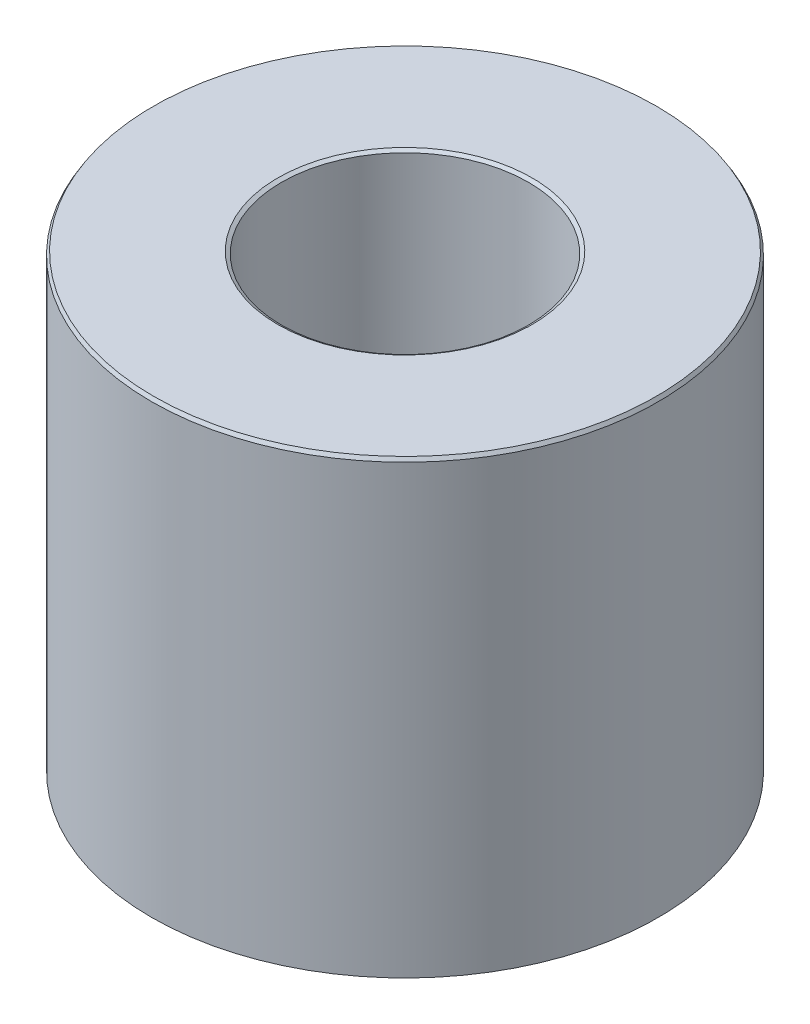
ISO-10303-21;
HEADER;
FILE_DESCRIPTION(('STEP AP214'),'2;1');
FILE_NAME('part.step','',(''),(''),'','','');
FILE_SCHEMA(('AUTOMOTIVE_DESIGN { 1 0 10303 214 1 1 1 1 }'));
ENDSEC;
DATA;
#1=APPLICATION_CONTEXT('core data for automotive mechanical design processes');
#2=APPLICATION_PROTOCOL_DEFINITION('international standard','automotive_design',2000,#1);
#3=PRODUCT_CONTEXT('',#1,'mechanical');
#4=PRODUCT('Part','Part','',(#3));
#5=PRODUCT_RELATED_PRODUCT_CATEGORY('part','',(#4));
#6=PRODUCT_DEFINITION_FORMATION('','',#4);
#7=PRODUCT_DEFINITION_CONTEXT('part definition',#1,'design');
#8=PRODUCT_DEFINITION('design','',#6,#7);
#9=PRODUCT_DEFINITION_SHAPE('','',#8);
#10=(LENGTH_UNIT() NAMED_UNIT(*) SI_UNIT(.MILLI.,.METRE.));
#11=(NAMED_UNIT(*) PLANE_ANGLE_UNIT() SI_UNIT($,.RADIAN.));
#12=(NAMED_UNIT(*) SI_UNIT($,.STERADIAN.) SOLID_ANGLE_UNIT());
#13=UNCERTAINTY_MEASURE_WITH_UNIT(LENGTH_MEASURE(1.E-05),#10,'distance_accuracy_value','');
#14=(GEOMETRIC_REPRESENTATION_CONTEXT(3) GLOBAL_UNCERTAINTY_ASSIGNED_CONTEXT((#13)) GLOBAL_UNIT_ASSIGNED_CONTEXT((#10,
#11,#12)) REPRESENTATION_CONTEXT('',''));
#15=CARTESIAN_POINT('',(0.,0.,0.));
#16=DIRECTION('',(0.,0.,1.));
#17=DIRECTION('',(1.,0.,0.));
#18=AXIS2_PLACEMENT_3D('',#15,#16,#17);
#19=CARTESIAN_POINT('',(0.,89.2140049411221,0.));
#20=DIRECTION('',(0.,-1.,0.));
#21=DIRECTION('',(0.,0.,-1.));
#22=AXIS2_PLACEMENT_3D('',#19,#20,#21);
#23=CYLINDRICAL_SURFACE('',#22,50.);
#24=CARTESIAN_POINT('',(0.,0.421142839623134,0.));
#25=DIRECTION('',(0.,1.,0.));
#26=DIRECTION('',(0.,0.,1.));
#27=AXIS2_PLACEMENT_3D('',#24,#25,#26);
#28=CIRCLE('',#27,50.);
#29=CARTESIAN_POINT('',(0.,0.421142839623134,50.));
#30=VERTEX_POINT('',#29);
#31=EDGE_CURVE('E10',#30,#30,#28,.T.);
#32=ORIENTED_EDGE('',*,*,#31,.T.);
#33=EDGE_LOOP('',(#32));
#34=FACE_BOUND('',#33,.T.);
#35=CARTESIAN_POINT('',(0.,88.5207360142283,0.));
#36=DIRECTION('',(0.,1.,0.));
#37=DIRECTION('',(0.,0.,1.));
#38=AXIS2_PLACEMENT_3D('',#35,#36,#37);
#39=CIRCLE('',#38,50.);
#40=CARTESIAN_POINT('',(0.,88.5207360142283,50.));
#41=VERTEX_POINT('',#40);
#42=EDGE_CURVE('E50',#41,#41,#39,.F.);
#43=ORIENTED_EDGE('',*,*,#42,.T.);
#44=EDGE_LOOP('',(#43));
#45=FACE_BOUND('',#44,.T.);
#46=ADVANCED_FACE('F39',(#34,#45),#23,.T.);
#47=CARTESIAN_POINT('',(0.,89.2140049411221,0.));
#48=DIRECTION('',(0.,1.,0.));
#49=DIRECTION('',(0.,0.,1.));
#50=AXIS2_PLACEMENT_3D('',#47,#48,#49);
#51=PLANE('',#50);
#52=CARTESIAN_POINT('',(0.,89.2140049411221,0.));
#53=DIRECTION('',(0.,1.,0.));
#54=DIRECTION('',(0.,0.,1.));
#55=AXIS2_PLACEMENT_3D('',#52,#53,#54);
#56=CIRCLE('',#55,25.0752482740782);
#57=CARTESIAN_POINT('',(0.,89.2140049411221,25.0752482740782));
#58=VERTEX_POINT('',#57);
#59=EDGE_CURVE('E58',#58,#58,#56,.F.);
#60=ORIENTED_EDGE('',*,*,#59,.T.);
#61=EDGE_LOOP('',(#60));
#62=FACE_BOUND('',#61,.T.);
#63=CARTESIAN_POINT('',(0.,89.2140049411221,0.));
#64=DIRECTION('',(0.,1.,0.));
#65=DIRECTION('',(0.,0.,1.));
#66=AXIS2_PLACEMENT_3D('',#63,#64,#65);
#67=CIRCLE('',#66,49.5788571603769);
#68=CARTESIAN_POINT('',(0.,89.2140049411221,49.5788571603769));
#69=VERTEX_POINT('',#68);
#70=EDGE_CURVE('E61',#69,#69,#67,.T.);
#71=ORIENTED_EDGE('',*,*,#70,.T.);
#72=EDGE_LOOP('',(#71));
#73=FACE_BOUND('',#72,.T.);
#74=ADVANCED_FACE('F88',(#62,#73),#51,.T.);
#75=CARTESIAN_POINT('',(0.,0.,0.));
#76=DIRECTION('',(0.,1.,0.));
#77=DIRECTION('',(0.,0.,1.));
#78=AXIS2_PLACEMENT_3D('',#75,#76,#77);
#79=PLANE('',#78);
#80=CARTESIAN_POINT('',(0.,0.,0.));
#81=DIRECTION('',(0.,1.,0.));
#82=DIRECTION('',(0.,0.,1.));
#83=AXIS2_PLACEMENT_3D('',#80,#81,#82);
#84=CIRCLE('',#83,24.8031221868074);
#85=CARTESIAN_POINT('',(0.,0.,24.8031221868074));
#86=VERTEX_POINT('',#85);
#87=EDGE_CURVE('E51',#86,#86,#84,.T.);
#88=ORIENTED_EDGE('',*,*,#87,.T.);
#89=EDGE_LOOP('',(#88));
#90=FACE_BOUND('',#89,.T.);
#91=CARTESIAN_POINT('',(0.,0.,0.));
#92=DIRECTION('',(0.,1.,0.));
#93=DIRECTION('',(0.,0.,1.));
#94=AXIS2_PLACEMENT_3D('',#91,#92,#93);
#95=CIRCLE('',#94,49.3067310731061);
#96=CARTESIAN_POINT('',(0.,0.,49.3067310731061));
#97=VERTEX_POINT('',#96);
#98=EDGE_CURVE('E54',#97,#97,#95,.F.);
#99=ORIENTED_EDGE('',*,*,#98,.T.);
#100=EDGE_LOOP('',(#99));
#101=FACE_BOUND('',#100,.T.);
#102=ADVANCED_FACE('F83',(#90,#101),#79,.F.);
#103=CARTESIAN_POINT('',(0.,89.2140049411221,0.));
#104=DIRECTION('',(0.,-1.,0.));
#105=DIRECTION('',(0.,0.,-1.));
#106=AXIS2_PLACEMENT_3D('',#103,#104,#105);
#107=CYLINDRICAL_SURFACE('',#106,24.3819793471842);
#108=CARTESIAN_POINT('',(0.,88.792862101499,0.));
#109=DIRECTION('',(0.,1.,0.));
#110=DIRECTION('',(0.,0.,1.));
#111=AXIS2_PLACEMENT_3D('',#108,#109,#110);
#112=CIRCLE('',#111,24.3819793471842);
#113=CARTESIAN_POINT('',(0.,88.792862101499,24.3819793471842));
#114=VERTEX_POINT('',#113);
#115=EDGE_CURVE('E67',#114,#114,#112,.T.);
#116=ORIENTED_EDGE('',*,*,#115,.T.);
#117=EDGE_LOOP('',(#116));
#118=FACE_BOUND('',#117,.T.);
#119=CARTESIAN_POINT('',(0.,0.69326892689392,0.));
#120=DIRECTION('',(0.,1.,0.));
#121=DIRECTION('',(0.,0.,1.));
#122=AXIS2_PLACEMENT_3D('',#119,#120,#121);
#123=CIRCLE('',#122,24.3819793471842);
#124=CARTESIAN_POINT('',(0.,0.69326892689392,24.3819793471842));
#125=VERTEX_POINT('',#124);
#126=EDGE_CURVE('E69',#125,#125,#123,.F.);
#127=ORIENTED_EDGE('',*,*,#126,.T.);
#128=EDGE_LOOP('',(#127));
#129=FACE_BOUND('',#128,.T.);
#130=ADVANCED_FACE('F71',(#118,#129),#107,.F.);
#131=CARTESIAN_POINT('',(0.,88.792862101499,0.));
#132=DIRECTION('',(0.,1.,0.));
#133=DIRECTION('',(0.,0.,1.));
#134=AXIS2_PLACEMENT_3D('',#131,#132,#133);
#135=CONICAL_SURFACE('',#134,24.3819793471842,1.02489936333593);
#136=ORIENTED_EDGE('',*,*,#59,.F.);
#137=EDGE_LOOP('',(#136));
#138=FACE_BOUND('',#137,.T.);
#139=ORIENTED_EDGE('',*,*,#115,.F.);
#140=EDGE_LOOP('',(#139));
#141=FACE_BOUND('',#140,.T.);
#142=ADVANCED_FACE('F77',(#138,#141),#135,.F.);
#143=CARTESIAN_POINT('',(0.,0.,0.));
#144=DIRECTION('',(0.,-1.,0.));
#145=DIRECTION('',(0.,0.,-1.));
#146=AXIS2_PLACEMENT_3D('',#143,#144,#145);
#147=CONICAL_SURFACE('',#146,24.8031221868074,0.54589696345894);
#148=ORIENTED_EDGE('',*,*,#126,.F.);
#149=EDGE_LOOP('',(#148));
#150=FACE_BOUND('',#149,.T.);
#151=ORIENTED_EDGE('',*,*,#87,.F.);
#152=EDGE_LOOP('',(#151));
#153=FACE_BOUND('',#152,.T.);
#154=ADVANCED_FACE('F73',(#150,#153),#147,.F.);
#155=CARTESIAN_POINT('',(0.,0.421142839623134,0.));
#156=DIRECTION('',(0.,1.,0.));
#157=DIRECTION('',(0.,0.,1.));
#158=AXIS2_PLACEMENT_3D('',#155,#156,#157);
#159=CONICAL_SURFACE('',#158,50.,1.02489936333595);
#160=ORIENTED_EDGE('',*,*,#98,.F.);
#161=EDGE_LOOP('',(#160));
#162=FACE_BOUND('',#161,.T.);
#163=ORIENTED_EDGE('',*,*,#31,.F.);
#164=EDGE_LOOP('',(#163));
#165=FACE_BOUND('',#164,.T.);
#166=ADVANCED_FACE('F76',(#162,#165),#159,.T.);
#167=CARTESIAN_POINT('',(0.,89.2140049411221,0.));
#168=DIRECTION('',(0.,-1.,0.));
#169=DIRECTION('',(0.,0.,-1.));
#170=AXIS2_PLACEMENT_3D('',#167,#168,#169);
#171=CONICAL_SURFACE('',#170,49.5788571603769,0.545896963458949);
#172=ORIENTED_EDGE('',*,*,#42,.F.);
#173=EDGE_LOOP('',(#172));
#174=FACE_BOUND('',#173,.T.);
#175=ORIENTED_EDGE('',*,*,#70,.F.);
#176=EDGE_LOOP('',(#175));
#177=FACE_BOUND('',#176,.T.);
#178=ADVANCED_FACE('F45',(#174,#177),#171,.T.);
#179=CLOSED_SHELL('',(#46,#74,#102,#130,#142,#154,#166,#178));
#180=MANIFOLD_SOLID_BREP('B2',#179);
#181=ADVANCED_BREP_SHAPE_REPRESENTATION('',(#18,#180),#14);
#182=SHAPE_DEFINITION_REPRESENTATION(#9,#181);
ENDSEC;
END-ISO-10303-21;
